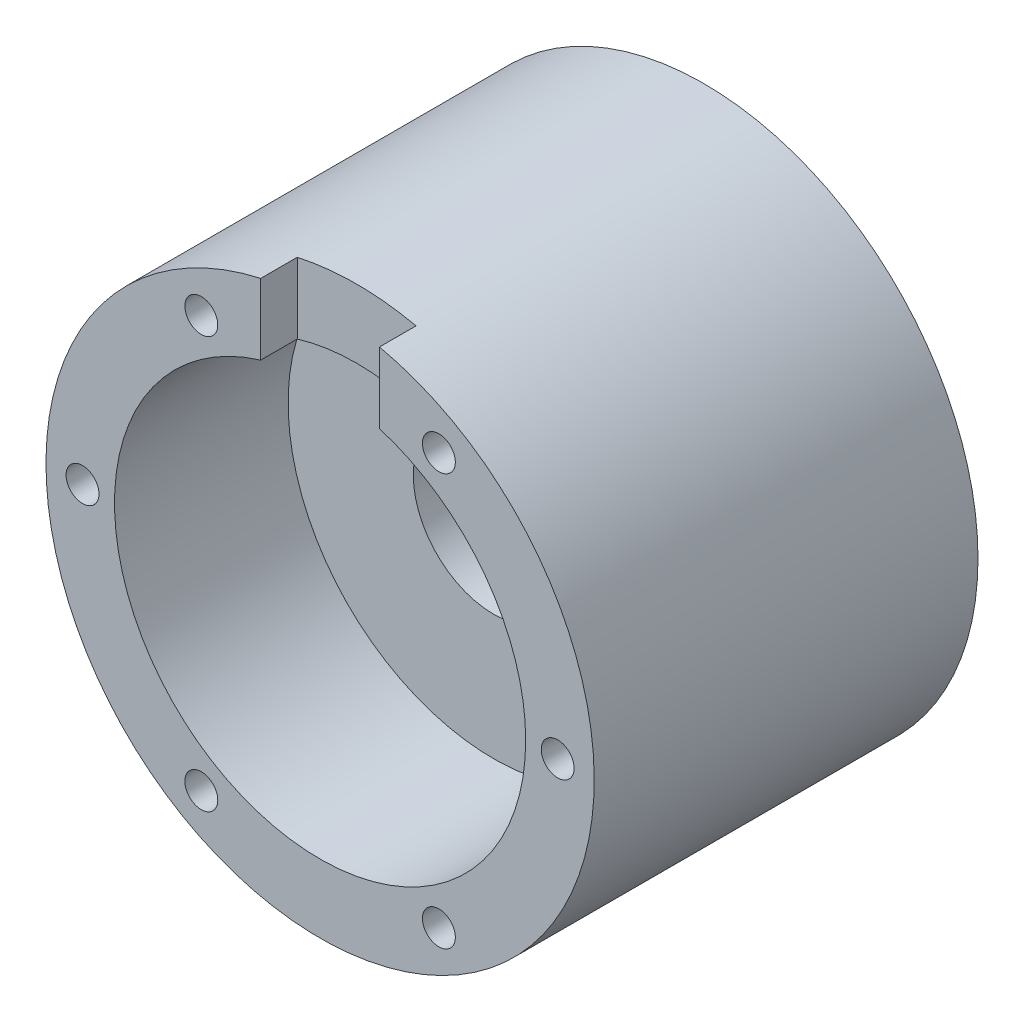
ISO-10303-21;
HEADER;
FILE_DESCRIPTION(('STEP AP214'),'2;1');
FILE_NAME('part.step','',(''),(''),'','','');
FILE_SCHEMA(('AUTOMOTIVE_DESIGN { 1 0 10303 214 1 1 1 1 }'));
ENDSEC;
DATA;
#1=APPLICATION_CONTEXT('core data for automotive mechanical design processes');
#2=APPLICATION_PROTOCOL_DEFINITION('international standard','automotive_design',2000,#1);
#3=PRODUCT_CONTEXT('',#1,'mechanical');
#4=PRODUCT('Part','Part','',(#3));
#5=PRODUCT_RELATED_PRODUCT_CATEGORY('part','',(#4));
#6=PRODUCT_DEFINITION_FORMATION('','',#4);
#7=PRODUCT_DEFINITION_CONTEXT('part definition',#1,'design');
#8=PRODUCT_DEFINITION('design','',#6,#7);
#9=PRODUCT_DEFINITION_SHAPE('','',#8);
#10=(LENGTH_UNIT() NAMED_UNIT(*) SI_UNIT(.MILLI.,.METRE.));
#11=(NAMED_UNIT(*) PLANE_ANGLE_UNIT() SI_UNIT($,.RADIAN.));
#12=(NAMED_UNIT(*) SI_UNIT($,.STERADIAN.) SOLID_ANGLE_UNIT());
#13=UNCERTAINTY_MEASURE_WITH_UNIT(LENGTH_MEASURE(1.E-05),#10,'distance_accuracy_value','');
#14=(GEOMETRIC_REPRESENTATION_CONTEXT(3) GLOBAL_UNCERTAINTY_ASSIGNED_CONTEXT((#13)) GLOBAL_UNIT_ASSIGNED_CONTEXT((#10,
#11,#12)) REPRESENTATION_CONTEXT('',''));
#15=CARTESIAN_POINT('',(0.,0.,0.));
#16=DIRECTION('',(0.,0.,1.));
#17=DIRECTION('',(1.,0.,0.));
#18=AXIS2_PLACEMENT_3D('',#15,#16,#17);
#19=CARTESIAN_POINT('',(0.,0.,21.));
#20=DIRECTION('',(0.,0.,-1.));
#21=DIRECTION('',(-1.,0.,0.));
#22=AXIS2_PLACEMENT_3D('',#19,#20,#21);
#23=CYLINDRICAL_SURFACE('',#22,4.4);
#24=CARTESIAN_POINT('',(0.,0.,4.));
#25=DIRECTION('',(0.,0.,-1.));
#26=DIRECTION('',(-1.,0.,0.));
#27=AXIS2_PLACEMENT_3D('',#24,#25,#26);
#28=CIRCLE('',#27,4.4);
#29=CARTESIAN_POINT('',(-4.4,0.,4.));
#30=VERTEX_POINT('',#29);
#31=EDGE_CURVE('E106',#30,#30,#28,.T.);
#32=ORIENTED_EDGE('',*,*,#31,.T.);
#33=EDGE_LOOP('',(#32));
#34=FACE_BOUND('',#33,.T.);
#35=CARTESIAN_POINT('',(0.,0.,11.5));
#36=DIRECTION('',(0.,0.,1.));
#37=DIRECTION('',(1.,0.,0.));
#38=AXIS2_PLACEMENT_3D('',#35,#36,#37);
#39=CIRCLE('',#38,4.4);
#40=CARTESIAN_POINT('',(4.4,0.,11.5));
#41=VERTEX_POINT('',#40);
#42=EDGE_CURVE('E114',#41,#41,#39,.T.);
#43=ORIENTED_EDGE('',*,*,#42,.T.);
#44=EDGE_LOOP('',(#43));
#45=FACE_BOUND('',#44,.T.);
#46=ADVANCED_FACE('F34',(#34,#45),#23,.F.);
#47=CARTESIAN_POINT('',(0.,6.25,21.));
#48=DIRECTION('',(0.,0.,-1.));
#49=DIRECTION('',(-1.,0.,0.));
#50=AXIS2_PLACEMENT_3D('',#47,#48,#49);
#51=CYLINDRICAL_SURFACE('',#50,1.45);
#52=CARTESIAN_POINT('',(0.,6.25,4.));
#53=DIRECTION('',(0.,0.,-1.));
#54=DIRECTION('',(-1.,0.,0.));
#55=AXIS2_PLACEMENT_3D('',#52,#53,#54);
#56=CIRCLE('',#55,1.45);
#57=CARTESIAN_POINT('',(0.,7.7,4.));
#58=VERTEX_POINT('',#57);
#59=EDGE_CURVE('E99',#58,#58,#56,.T.);
#60=ORIENTED_EDGE('',*,*,#59,.T.);
#61=EDGE_LOOP('',(#60));
#62=FACE_BOUND('',#61,.T.);
#63=CARTESIAN_POINT('',(0.,6.25,11.5));
#64=DIRECTION('',(0.,0.,1.));
#65=DIRECTION('',(1.,0.,0.));
#66=AXIS2_PLACEMENT_3D('',#63,#64,#65);
#67=CIRCLE('',#66,1.45);
#68=CARTESIAN_POINT('',(1.45,6.25,11.5));
#69=VERTEX_POINT('',#68);
#70=EDGE_CURVE('E111',#69,#69,#67,.T.);
#71=ORIENTED_EDGE('',*,*,#70,.T.);
#72=EDGE_LOOP('',(#71));
#73=FACE_BOUND('',#72,.T.);
#74=ADVANCED_FACE('F191',(#62,#73),#51,.F.);
#75=CARTESIAN_POINT('',(0.,0.,21.));
#76=DIRECTION('',(0.,0.,1.));
#77=DIRECTION('',(1.,0.,0.));
#78=AXIS2_PLACEMENT_3D('',#75,#76,#77);
#79=PLANE('',#78);
#80=DIRECTION('',(0.,-1.,0.));
#81=VECTOR('',#80,1.);
#82=CARTESIAN_POINT('',(-3.25,7.5,21.));
#83=LINE('',#82,#81);
#84=CARTESIAN_POINT('',(-3.25,14.6436846456075,21.));
#85=VERTEX_POINT('',#84);
#86=CARTESIAN_POINT('',(-3.25,10.770329614269,21.));
#87=VERTEX_POINT('',#86);
#88=EDGE_CURVE('E79',#85,#87,#83,.T.);
#89=ORIENTED_EDGE('',*,*,#88,.F.);
#90=CARTESIAN_POINT('',(0.,0.,21.));
#91=DIRECTION('',(0.,0.,1.));
#92=DIRECTION('',(1.,0.,0.));
#93=AXIS2_PLACEMENT_3D('',#90,#91,#92);
#94=CIRCLE('',#93,15.);
#95=CARTESIAN_POINT('',(3.25,14.6436846456075,21.));
#96=VERTEX_POINT('',#95);
#97=EDGE_CURVE('E92',#85,#96,#94,.T.);
#98=ORIENTED_EDGE('',*,*,#97,.T.);
#99=DIRECTION('',(0.,1.,0.));
#100=VECTOR('',#99,1.);
#101=CARTESIAN_POINT('',(3.25,7.5,21.));
#102=LINE('',#101,#100);
#103=CARTESIAN_POINT('',(3.25,10.770329614269,21.));
#104=VERTEX_POINT('',#103);
#105=EDGE_CURVE('E95',#104,#96,#102,.T.);
#106=ORIENTED_EDGE('',*,*,#105,.F.);
#107=CARTESIAN_POINT('',(0.,0.,21.));
#108=DIRECTION('',(0.,0.,1.));
#109=DIRECTION('',(1.,0.,0.));
#110=AXIS2_PLACEMENT_3D('',#107,#108,#109);
#111=CIRCLE('',#110,11.25);
#112=EDGE_CURVE('E94',#87,#104,#111,.T.);
#113=ORIENTED_EDGE('',*,*,#112,.F.);
#114=EDGE_LOOP('',(#89,#98,#106,#113));
#115=FACE_BOUND('',#114,.T.);
#116=CARTESIAN_POINT('',(6.49999999999997,-11.2583302491977,21.));
#117=DIRECTION('',(0.,0.,1.));
#118=DIRECTION('',(1.,0.,0.));
#119=AXIS2_PLACEMENT_3D('',#116,#117,#118);
#120=CIRCLE('',#119,0.899999999999999);
#121=CARTESIAN_POINT('',(7.39999999999997,-11.2583302491977,21.));
#122=VERTEX_POINT('',#121);
#123=EDGE_CURVE('E136',#122,#122,#120,.T.);
#124=ORIENTED_EDGE('',*,*,#123,.F.);
#125=EDGE_LOOP('',(#124));
#126=FACE_BOUND('',#125,.T.);
#127=CARTESIAN_POINT('',(-6.50000000000005,-11.2583302491977,21.));
#128=DIRECTION('',(0.,0.,1.));
#129=DIRECTION('',(1.,0.,0.));
#130=AXIS2_PLACEMENT_3D('',#127,#128,#129);
#131=CIRCLE('',#130,0.899999999999999);
#132=CARTESIAN_POINT('',(-5.60000000000005,-11.2583302491977,21.));
#133=VERTEX_POINT('',#132);
#134=EDGE_CURVE('E142',#133,#133,#131,.T.);
#135=ORIENTED_EDGE('',*,*,#134,.F.);
#136=EDGE_LOOP('',(#135));
#137=FACE_BOUND('',#136,.T.);
#138=CARTESIAN_POINT('',(-13.,0.,21.));
#139=DIRECTION('',(0.,0.,1.));
#140=DIRECTION('',(1.,0.,0.));
#141=AXIS2_PLACEMENT_3D('',#138,#139,#140);
#142=CIRCLE('',#141,0.9);
#143=CARTESIAN_POINT('',(-12.1,0.,21.));
#144=VERTEX_POINT('',#143);
#145=EDGE_CURVE('E148',#144,#144,#142,.T.);
#146=ORIENTED_EDGE('',*,*,#145,.F.);
#147=EDGE_LOOP('',(#146));
#148=FACE_BOUND('',#147,.T.);
#149=CARTESIAN_POINT('',(-6.4999999999999,11.2583302491978,21.));
#150=DIRECTION('',(0.,0.,1.));
#151=DIRECTION('',(1.,0.,0.));
#152=AXIS2_PLACEMENT_3D('',#149,#150,#151);
#153=CIRCLE('',#152,0.899999999999999);
#154=CARTESIAN_POINT('',(-5.59999999999989,11.2583302491978,21.));
#155=VERTEX_POINT('',#154);
#156=EDGE_CURVE('E154',#155,#155,#153,.T.);
#157=ORIENTED_EDGE('',*,*,#156,.F.);
#158=EDGE_LOOP('',(#157));
#159=FACE_BOUND('',#158,.T.);
#160=CARTESIAN_POINT('',(6.50000000000013,11.2583302491976,21.));
#161=DIRECTION('',(0.,0.,1.));
#162=DIRECTION('',(1.,0.,0.));
#163=AXIS2_PLACEMENT_3D('',#160,#161,#162);
#164=CIRCLE('',#163,0.899999999999999);
#165=CARTESIAN_POINT('',(7.40000000000013,11.2583302491976,21.));
#166=VERTEX_POINT('',#165);
#167=EDGE_CURVE('E83',#166,#166,#164,.T.);
#168=ORIENTED_EDGE('',*,*,#167,.F.);
#169=EDGE_LOOP('',(#168));
#170=FACE_BOUND('',#169,.T.);
#171=CARTESIAN_POINT('',(13.,0.,21.));
#172=DIRECTION('',(0.,0.,1.));
#173=DIRECTION('',(1.,0.,0.));
#174=AXIS2_PLACEMENT_3D('',#171,#172,#173);
#175=CIRCLE('',#174,0.9);
#176=CARTESIAN_POINT('',(13.9,0.,21.));
#177=VERTEX_POINT('',#176);
#178=EDGE_CURVE('E135',#177,#177,#175,.T.);
#179=ORIENTED_EDGE('',*,*,#178,.F.);
#180=EDGE_LOOP('',(#179));
#181=FACE_BOUND('',#180,.T.);
#182=ADVANCED_FACE('F89',(#115,#126,#137,#148,#159,#170,#181),#79,.T.);
#183=CARTESIAN_POINT('',(0.,0.,0.));
#184=DIRECTION('',(0.,0.,1.));
#185=DIRECTION('',(1.,0.,0.));
#186=AXIS2_PLACEMENT_3D('',#183,#184,#185);
#187=PLANE('',#186);
#188=CARTESIAN_POINT('',(0.,0.,0.));
#189=DIRECTION('',(0.,0.,-1.));
#190=DIRECTION('',(-1.,0.,0.));
#191=AXIS2_PLACEMENT_3D('',#188,#189,#190);
#192=CIRCLE('',#191,7.7);
#193=CARTESIAN_POINT('',(-7.7,0.,0.));
#194=VERTEX_POINT('',#193);
#195=EDGE_CURVE('E172',#194,#194,#192,.T.);
#196=ORIENTED_EDGE('',*,*,#195,.F.);
#197=EDGE_LOOP('',(#196));
#198=FACE_BOUND('',#197,.T.);
#199=CARTESIAN_POINT('',(0.,0.,0.));
#200=DIRECTION('',(0.,0.,1.));
#201=DIRECTION('',(1.,0.,0.));
#202=AXIS2_PLACEMENT_3D('',#199,#200,#201);
#203=CIRCLE('',#202,15.);
#204=CARTESIAN_POINT('',(15.,0.,0.));
#205=VERTEX_POINT('',#204);
#206=EDGE_CURVE('E100',#205,#205,#203,.T.);
#207=ORIENTED_EDGE('',*,*,#206,.F.);
#208=EDGE_LOOP('',(#207));
#209=FACE_BOUND('',#208,.T.);
#210=ADVANCED_FACE('F178',(#198,#209),#187,.F.);
#211=CARTESIAN_POINT('',(0.,0.,21.));
#212=DIRECTION('',(0.,0.,-1.));
#213=DIRECTION('',(-1.,0.,0.));
#214=AXIS2_PLACEMENT_3D('',#211,#212,#213);
#215=CYLINDRICAL_SURFACE('',#214,15.);
#216=ORIENTED_EDGE('',*,*,#97,.F.);
#217=DIRECTION('',(0.,0.,-1.));
#218=VECTOR('',#217,1.);
#219=CARTESIAN_POINT('',(-3.25,14.6436846456075,21.));
#220=LINE('',#219,#218);
#221=CARTESIAN_POINT('',(-3.25,14.6436846456075,19.));
#222=VERTEX_POINT('',#221);
#223=EDGE_CURVE('E76',#85,#222,#220,.T.);
#224=ORIENTED_EDGE('',*,*,#223,.T.);
#225=CARTESIAN_POINT('',(0.,0.,19.));
#226=DIRECTION('',(0.,0.,1.));
#227=DIRECTION('',(1.,0.,0.));
#228=AXIS2_PLACEMENT_3D('',#225,#226,#227);
#229=CIRCLE('',#228,15.);
#230=CARTESIAN_POINT('',(3.25,14.6436846456075,19.));
#231=VERTEX_POINT('',#230);
#232=EDGE_CURVE('E129',#231,#222,#229,.T.);
#233=ORIENTED_EDGE('',*,*,#232,.F.);
#234=DIRECTION('',(0.,0.,-1.));
#235=VECTOR('',#234,1.);
#236=CARTESIAN_POINT('',(3.25,14.6436846456075,21.));
#237=LINE('',#236,#235);
#238=EDGE_CURVE('E84',#231,#96,#237,.F.);
#239=ORIENTED_EDGE('',*,*,#238,.T.);
#240=EDGE_LOOP('',(#216,#224,#233,#239));
#241=FACE_BOUND('',#240,.T.);
#242=ORIENTED_EDGE('',*,*,#206,.T.);
#243=EDGE_LOOP('',(#242));
#244=FACE_BOUND('',#243,.T.);
#245=ADVANCED_FACE('F36',(#241,#244),#215,.T.);
#246=CARTESIAN_POINT('',(0.,0.,4.));
#247=DIRECTION('',(0.,0.,-1.));
#248=DIRECTION('',(-1.,0.,0.));
#249=AXIS2_PLACEMENT_3D('',#246,#247,#248);
#250=CYLINDRICAL_SURFACE('',#249,7.7);
#251=ORIENTED_EDGE('',*,*,#195,.T.);
#252=EDGE_LOOP('',(#251));
#253=FACE_BOUND('',#252,.T.);
#254=CARTESIAN_POINT('',(0.,0.,4.));
#255=DIRECTION('',(0.,0.,-1.));
#256=DIRECTION('',(-1.,0.,0.));
#257=AXIS2_PLACEMENT_3D('',#254,#255,#256);
#258=CIRCLE('',#257,7.7);
#259=EDGE_CURVE('E55',#58,#58,#258,.T.);
#260=ORIENTED_EDGE('',*,*,#259,.F.);
#261=EDGE_LOOP('',(#260));
#262=FACE_BOUND('',#261,.T.);
#263=ADVANCED_FACE('F176',(#253,#262),#250,.F.);
#264=CARTESIAN_POINT('',(0.,0.,4.));
#265=DIRECTION('',(0.,0.,-1.));
#266=DIRECTION('',(-1.,0.,0.));
#267=AXIS2_PLACEMENT_3D('',#264,#265,#266);
#268=PLANE('',#267);
#269=ORIENTED_EDGE('',*,*,#31,.F.);
#270=EDGE_LOOP('',(#269));
#271=FACE_BOUND('',#270,.T.);
#272=ORIENTED_EDGE('',*,*,#259,.T.);
#273=ORIENTED_EDGE('',*,*,#59,.F.);
#274=EDGE_LOOP('',(#272,#273));
#275=FACE_BOUND('',#274,.T.);
#276=ADVANCED_FACE('F188',(#271,#275),#268,.T.);
#277=CARTESIAN_POINT('',(0.,0.,11.5));
#278=DIRECTION('',(0.,0.,1.));
#279=DIRECTION('',(1.,0.,0.));
#280=AXIS2_PLACEMENT_3D('',#277,#278,#279);
#281=CYLINDRICAL_SURFACE('',#280,11.25);
#282=CARTESIAN_POINT('',(0.,0.,11.5));
#283=DIRECTION('',(0.,0.,1.));
#284=DIRECTION('',(1.,0.,0.));
#285=AXIS2_PLACEMENT_3D('',#282,#283,#284);
#286=CIRCLE('',#285,11.25);
#287=CARTESIAN_POINT('',(11.25,0.,11.5));
#288=VERTEX_POINT('',#287);
#289=EDGE_CURVE('E115',#288,#288,#286,.T.);
#290=ORIENTED_EDGE('',*,*,#289,.F.);
#291=EDGE_LOOP('',(#290));
#292=FACE_BOUND('',#291,.T.);
#293=CARTESIAN_POINT('',(0.,0.,19.));
#294=DIRECTION('',(0.,0.,1.));
#295=DIRECTION('',(1.,0.,0.));
#296=AXIS2_PLACEMENT_3D('',#293,#294,#295);
#297=CIRCLE('',#296,11.25);
#298=CARTESIAN_POINT('',(-3.25,10.770329614269,19.));
#299=VERTEX_POINT('',#298);
#300=CARTESIAN_POINT('',(3.25,10.770329614269,19.));
#301=VERTEX_POINT('',#300);
#302=EDGE_CURVE('E103',#299,#301,#297,.F.);
#303=ORIENTED_EDGE('',*,*,#302,.F.);
#304=DIRECTION('',(0.,0.,1.));
#305=VECTOR('',#304,1.);
#306=CARTESIAN_POINT('',(-3.25,10.770329614269,11.5));
#307=LINE('',#306,#305);
#308=EDGE_CURVE('E11',#299,#87,#307,.T.);
#309=ORIENTED_EDGE('',*,*,#308,.T.);
#310=ORIENTED_EDGE('',*,*,#112,.T.);
#311=DIRECTION('',(0.,0.,1.));
#312=VECTOR('',#311,1.);
#313=CARTESIAN_POINT('',(3.25,10.770329614269,11.5));
#314=LINE('',#313,#312);
#315=EDGE_CURVE('E42',#104,#301,#314,.F.);
#316=ORIENTED_EDGE('',*,*,#315,.T.);
#317=EDGE_LOOP('',(#303,#309,#310,#316));
#318=FACE_BOUND('',#317,.T.);
#319=ADVANCED_FACE('F119',(#292,#318),#281,.F.);
#320=CARTESIAN_POINT('',(0.,0.,11.5));
#321=DIRECTION('',(0.,0.,1.));
#322=DIRECTION('',(1.,0.,0.));
#323=AXIS2_PLACEMENT_3D('',#320,#321,#322);
#324=PLANE('',#323);
#325=ORIENTED_EDGE('',*,*,#42,.F.);
#326=EDGE_LOOP('',(#325));
#327=FACE_BOUND('',#326,.T.);
#328=ORIENTED_EDGE('',*,*,#70,.F.);
#329=EDGE_LOOP('',(#328));
#330=FACE_BOUND('',#329,.T.);
#331=ORIENTED_EDGE('',*,*,#289,.T.);
#332=EDGE_LOOP('',(#331));
#333=FACE_BOUND('',#332,.T.);
#334=ADVANCED_FACE('F324',(#327,#330,#333),#324,.T.);
#335=CARTESIAN_POINT('',(13.,0.,17.));
#336=DIRECTION('',(0.,0.,1.));
#337=DIRECTION('',(1.,0.,0.));
#338=AXIS2_PLACEMENT_3D('',#335,#336,#337);
#339=CYLINDRICAL_SURFACE('',#338,0.9);
#340=CARTESIAN_POINT('',(13.,0.,17.));
#341=DIRECTION('',(0.,0.,1.));
#342=DIRECTION('',(1.,0.,0.));
#343=AXIS2_PLACEMENT_3D('',#340,#341,#342);
#344=CIRCLE('',#343,0.9);
#345=CARTESIAN_POINT('',(13.9,0.,17.));
#346=VERTEX_POINT('',#345);
#347=EDGE_CURVE('E162',#346,#346,#344,.T.);
#348=ORIENTED_EDGE('',*,*,#347,.F.);
#349=EDGE_LOOP('',(#348));
#350=FACE_BOUND('',#349,.T.);
#351=ORIENTED_EDGE('',*,*,#178,.T.);
#352=EDGE_LOOP('',(#351));
#353=FACE_BOUND('',#352,.T.);
#354=ADVANCED_FACE('F314',(#350,#353),#339,.F.);
#355=CARTESIAN_POINT('',(13.,0.,17.));
#356=DIRECTION('',(0.,0.,1.));
#357=DIRECTION('',(1.,0.,0.));
#358=AXIS2_PLACEMENT_3D('',#355,#356,#357);
#359=PLANE('',#358);
#360=ORIENTED_EDGE('',*,*,#347,.T.);
#361=EDGE_LOOP('',(#360));
#362=FACE_BOUND('',#361,.T.);
#363=ADVANCED_FACE('F304',(#362),#359,.T.);
#364=CARTESIAN_POINT('',(6.50000000000013,11.2583302491976,17.));
#365=DIRECTION('',(0.,0.,1.));
#366=DIRECTION('',(1.,0.,0.));
#367=AXIS2_PLACEMENT_3D('',#364,#365,#366);
#368=CYLINDRICAL_SURFACE('',#367,0.899999999999999);
#369=CARTESIAN_POINT('',(6.50000000000013,11.2583302491976,17.));
#370=DIRECTION('',(0.,0.,1.));
#371=DIRECTION('',(1.,0.,0.));
#372=AXIS2_PLACEMENT_3D('',#369,#370,#371);
#373=CIRCLE('',#372,0.899999999999999);
#374=CARTESIAN_POINT('',(7.40000000000013,11.2583302491976,17.));
#375=VERTEX_POINT('',#374);
#376=EDGE_CURVE('E157',#375,#375,#373,.T.);
#377=ORIENTED_EDGE('',*,*,#376,.F.);
#378=EDGE_LOOP('',(#377));
#379=FACE_BOUND('',#378,.T.);
#380=ORIENTED_EDGE('',*,*,#167,.T.);
#381=EDGE_LOOP('',(#380));
#382=FACE_BOUND('',#381,.T.);
#383=ADVANCED_FACE('F294',(#379,#382),#368,.F.);
#384=CARTESIAN_POINT('',(6.50000000000013,11.2583302491976,17.));
#385=DIRECTION('',(0.,0.,1.));
#386=DIRECTION('',(1.,0.,0.));
#387=AXIS2_PLACEMENT_3D('',#384,#385,#386);
#388=PLANE('',#387);
#389=ORIENTED_EDGE('',*,*,#376,.T.);
#390=EDGE_LOOP('',(#389));
#391=FACE_BOUND('',#390,.T.);
#392=ADVANCED_FACE('F284',(#391),#388,.T.);
#393=CARTESIAN_POINT('',(-6.4999999999999,11.2583302491978,17.));
#394=DIRECTION('',(0.,0.,1.));
#395=DIRECTION('',(1.,0.,0.));
#396=AXIS2_PLACEMENT_3D('',#393,#394,#395);
#397=CYLINDRICAL_SURFACE('',#396,0.899999999999999);
#398=CARTESIAN_POINT('',(-6.4999999999999,11.2583302491978,17.));
#399=DIRECTION('',(0.,0.,1.));
#400=DIRECTION('',(1.,0.,0.));
#401=AXIS2_PLACEMENT_3D('',#398,#399,#400);
#402=CIRCLE('',#401,0.899999999999999);
#403=CARTESIAN_POINT('',(-5.59999999999989,11.2583302491978,17.));
#404=VERTEX_POINT('',#403);
#405=EDGE_CURVE('E151',#404,#404,#402,.T.);
#406=ORIENTED_EDGE('',*,*,#405,.F.);
#407=EDGE_LOOP('',(#406));
#408=FACE_BOUND('',#407,.T.);
#409=ORIENTED_EDGE('',*,*,#156,.T.);
#410=EDGE_LOOP('',(#409));
#411=FACE_BOUND('',#410,.T.);
#412=ADVANCED_FACE('F274',(#408,#411),#397,.F.);
#413=CARTESIAN_POINT('',(-6.4999999999999,11.2583302491978,17.));
#414=DIRECTION('',(0.,0.,1.));
#415=DIRECTION('',(1.,0.,0.));
#416=AXIS2_PLACEMENT_3D('',#413,#414,#415);
#417=PLANE('',#416);
#418=ORIENTED_EDGE('',*,*,#405,.T.);
#419=EDGE_LOOP('',(#418));
#420=FACE_BOUND('',#419,.T.);
#421=ADVANCED_FACE('F264',(#420),#417,.T.);
#422=CARTESIAN_POINT('',(-13.,0.,17.));
#423=DIRECTION('',(0.,0.,1.));
#424=DIRECTION('',(1.,0.,0.));
#425=AXIS2_PLACEMENT_3D('',#422,#423,#424);
#426=CYLINDRICAL_SURFACE('',#425,0.9);
#427=CARTESIAN_POINT('',(-13.,0.,17.));
#428=DIRECTION('',(0.,0.,1.));
#429=DIRECTION('',(1.,0.,0.));
#430=AXIS2_PLACEMENT_3D('',#427,#428,#429);
#431=CIRCLE('',#430,0.9);
#432=CARTESIAN_POINT('',(-12.1,0.,17.));
#433=VERTEX_POINT('',#432);
#434=EDGE_CURVE('E145',#433,#433,#431,.T.);
#435=ORIENTED_EDGE('',*,*,#434,.F.);
#436=EDGE_LOOP('',(#435));
#437=FACE_BOUND('',#436,.T.);
#438=ORIENTED_EDGE('',*,*,#145,.T.);
#439=EDGE_LOOP('',(#438));
#440=FACE_BOUND('',#439,.T.);
#441=ADVANCED_FACE('F254',(#437,#440),#426,.F.);
#442=CARTESIAN_POINT('',(-13.,0.,17.));
#443=DIRECTION('',(0.,0.,1.));
#444=DIRECTION('',(1.,0.,0.));
#445=AXIS2_PLACEMENT_3D('',#442,#443,#444);
#446=PLANE('',#445);
#447=ORIENTED_EDGE('',*,*,#434,.T.);
#448=EDGE_LOOP('',(#447));
#449=FACE_BOUND('',#448,.T.);
#450=ADVANCED_FACE('F244',(#449),#446,.T.);
#451=CARTESIAN_POINT('',(-6.50000000000005,-11.2583302491977,17.));
#452=DIRECTION('',(0.,0.,1.));
#453=DIRECTION('',(1.,0.,0.));
#454=AXIS2_PLACEMENT_3D('',#451,#452,#453);
#455=CYLINDRICAL_SURFACE('',#454,0.899999999999999);
#456=CARTESIAN_POINT('',(-6.50000000000005,-11.2583302491977,17.));
#457=DIRECTION('',(0.,0.,1.));
#458=DIRECTION('',(1.,0.,0.));
#459=AXIS2_PLACEMENT_3D('',#456,#457,#458);
#460=CIRCLE('',#459,0.899999999999999);
#461=CARTESIAN_POINT('',(-5.60000000000005,-11.2583302491977,17.));
#462=VERTEX_POINT('',#461);
#463=EDGE_CURVE('E139',#462,#462,#460,.T.);
#464=ORIENTED_EDGE('',*,*,#463,.F.);
#465=EDGE_LOOP('',(#464));
#466=FACE_BOUND('',#465,.T.);
#467=ORIENTED_EDGE('',*,*,#134,.T.);
#468=EDGE_LOOP('',(#467));
#469=FACE_BOUND('',#468,.T.);
#470=ADVANCED_FACE('F234',(#466,#469),#455,.F.);
#471=CARTESIAN_POINT('',(-6.50000000000005,-11.2583302491977,17.));
#472=DIRECTION('',(0.,0.,1.));
#473=DIRECTION('',(1.,0.,0.));
#474=AXIS2_PLACEMENT_3D('',#471,#472,#473);
#475=PLANE('',#474);
#476=ORIENTED_EDGE('',*,*,#463,.T.);
#477=EDGE_LOOP('',(#476));
#478=FACE_BOUND('',#477,.T.);
#479=ADVANCED_FACE('F224',(#478),#475,.T.);
#480=CARTESIAN_POINT('',(6.49999999999997,-11.2583302491977,17.));
#481=DIRECTION('',(0.,0.,1.));
#482=DIRECTION('',(1.,0.,0.));
#483=AXIS2_PLACEMENT_3D('',#480,#481,#482);
#484=CYLINDRICAL_SURFACE('',#483,0.899999999999999);
#485=CARTESIAN_POINT('',(6.49999999999997,-11.2583302491977,17.));
#486=DIRECTION('',(0.,0.,1.));
#487=DIRECTION('',(1.,0.,0.));
#488=AXIS2_PLACEMENT_3D('',#485,#486,#487);
#489=CIRCLE('',#488,0.899999999999999);
#490=CARTESIAN_POINT('',(7.39999999999997,-11.2583302491977,17.));
#491=VERTEX_POINT('',#490);
#492=EDGE_CURVE('E132',#491,#491,#489,.T.);
#493=ORIENTED_EDGE('',*,*,#492,.F.);
#494=EDGE_LOOP('',(#493));
#495=FACE_BOUND('',#494,.T.);
#496=ORIENTED_EDGE('',*,*,#123,.T.);
#497=EDGE_LOOP('',(#496));
#498=FACE_BOUND('',#497,.T.);
#499=ADVANCED_FACE('F212',(#495,#498),#484,.F.);
#500=CARTESIAN_POINT('',(6.49999999999997,-11.2583302491977,17.));
#501=DIRECTION('',(0.,0.,1.));
#502=DIRECTION('',(1.,0.,0.));
#503=AXIS2_PLACEMENT_3D('',#500,#501,#502);
#504=PLANE('',#503);
#505=ORIENTED_EDGE('',*,*,#492,.T.);
#506=EDGE_LOOP('',(#505));
#507=FACE_BOUND('',#506,.T.);
#508=ADVANCED_FACE('F207',(#507),#504,.T.);
#509=CARTESIAN_POINT('',(-3.25,7.5,19.));
#510=DIRECTION('',(-1.,0.,0.));
#511=DIRECTION('',(0.,0.,1.));
#512=AXIS2_PLACEMENT_3D('',#509,#510,#511);
#513=PLANE('',#512);
#514=ORIENTED_EDGE('',*,*,#88,.T.);
#515=ORIENTED_EDGE('',*,*,#308,.F.);
#516=DIRECTION('',(0.,-1.,0.));
#517=VECTOR('',#516,1.);
#518=CARTESIAN_POINT('',(-3.25,7.5,19.));
#519=LINE('',#518,#517);
#520=EDGE_CURVE('E49',#222,#299,#519,.T.);
#521=ORIENTED_EDGE('',*,*,#520,.F.);
#522=ORIENTED_EDGE('',*,*,#223,.F.);
#523=EDGE_LOOP('',(#514,#515,#521,#522));
#524=FACE_BOUND('',#523,.T.);
#525=ADVANCED_FACE('F78',(#524),#513,.F.);
#526=CARTESIAN_POINT('',(3.25,7.5,19.));
#527=DIRECTION('',(1.,0.,0.));
#528=DIRECTION('',(0.,0.,-1.));
#529=AXIS2_PLACEMENT_3D('',#526,#527,#528);
#530=PLANE('',#529);
#531=DIRECTION('',(0.,1.,0.));
#532=VECTOR('',#531,1.);
#533=CARTESIAN_POINT('',(3.25,7.5,19.));
#534=LINE('',#533,#532);
#535=EDGE_CURVE('E124',#301,#231,#534,.T.);
#536=ORIENTED_EDGE('',*,*,#535,.F.);
#537=ORIENTED_EDGE('',*,*,#315,.F.);
#538=ORIENTED_EDGE('',*,*,#105,.T.);
#539=ORIENTED_EDGE('',*,*,#238,.F.);
#540=EDGE_LOOP('',(#536,#537,#538,#539));
#541=FACE_BOUND('',#540,.T.);
#542=ADVANCED_FACE('F122',(#541),#530,.F.);
#543=CARTESIAN_POINT('',(0.,0.,19.));
#544=DIRECTION('',(0.,0.,1.));
#545=DIRECTION('',(1.,0.,0.));
#546=AXIS2_PLACEMENT_3D('',#543,#544,#545);
#547=PLANE('',#546);
#548=ORIENTED_EDGE('',*,*,#232,.T.);
#549=ORIENTED_EDGE('',*,*,#520,.T.);
#550=ORIENTED_EDGE('',*,*,#302,.T.);
#551=ORIENTED_EDGE('',*,*,#535,.T.);
#552=EDGE_LOOP('',(#548,#549,#550,#551));
#553=FACE_BOUND('',#552,.T.);
#554=ADVANCED_FACE('F394',(#553),#547,.T.);
#555=CLOSED_SHELL('',(#46,#74,#182,#210,#245,#263,#276,#319,#334,#354,#363,#383,#392,#412,#421,
#441,#450,#470,#479,#499,#508,#525,#542,#554));
#556=MANIFOLD_SOLID_BREP('B2',#555);
#557=ADVANCED_BREP_SHAPE_REPRESENTATION('',(#18,#556),#14);
#558=SHAPE_DEFINITION_REPRESENTATION(#9,#557);
ENDSEC;
END-ISO-10303-21;
